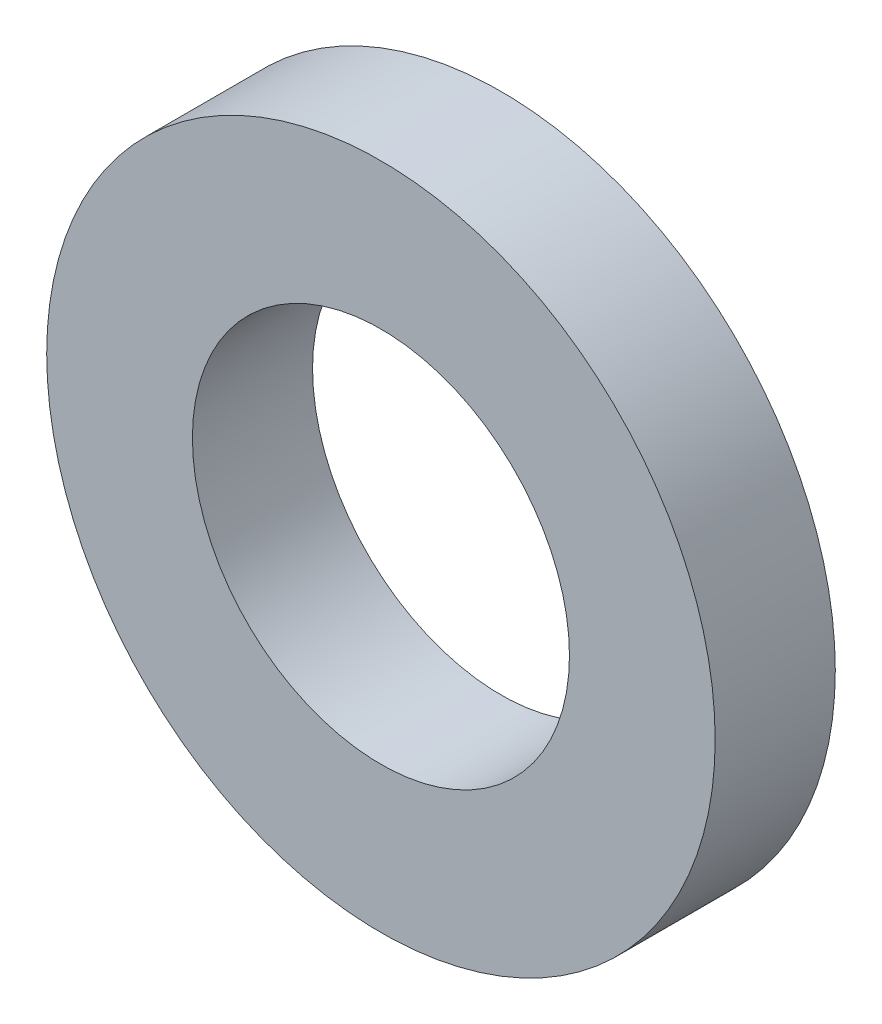
ISO-10303-21;
HEADER;
FILE_DESCRIPTION(('STEP AP214'),'2;1');
FILE_NAME('part.step','',(''),(''),'','','');
FILE_SCHEMA(('AUTOMOTIVE_DESIGN { 1 0 10303 214 1 1 1 1 }'));
ENDSEC;
DATA;
#1=APPLICATION_CONTEXT('core data for automotive mechanical design processes');
#2=APPLICATION_PROTOCOL_DEFINITION('international standard','automotive_design',2000,#1);
#3=PRODUCT_CONTEXT('',#1,'mechanical');
#4=PRODUCT('Part','Part','',(#3));
#5=PRODUCT_RELATED_PRODUCT_CATEGORY('part','',(#4));
#6=PRODUCT_DEFINITION_FORMATION('','',#4);
#7=PRODUCT_DEFINITION_CONTEXT('part definition',#1,'design');
#8=PRODUCT_DEFINITION('design','',#6,#7);
#9=PRODUCT_DEFINITION_SHAPE('','',#8);
#10=(LENGTH_UNIT() NAMED_UNIT(*) SI_UNIT(.MILLI.,.METRE.));
#11=(NAMED_UNIT(*) PLANE_ANGLE_UNIT() SI_UNIT($,.RADIAN.));
#12=(NAMED_UNIT(*) SI_UNIT($,.STERADIAN.) SOLID_ANGLE_UNIT());
#13=UNCERTAINTY_MEASURE_WITH_UNIT(LENGTH_MEASURE(1.E-05),#10,'distance_accuracy_value','');
#14=(GEOMETRIC_REPRESENTATION_CONTEXT(3) GLOBAL_UNCERTAINTY_ASSIGNED_CONTEXT((#13)) GLOBAL_UNIT_ASSIGNED_CONTEXT((#10,
#11,#12)) REPRESENTATION_CONTEXT('',''));
#15=CARTESIAN_POINT('',(0.,0.,0.));
#16=DIRECTION('',(0.,0.,1.));
#17=DIRECTION('',(1.,0.,0.));
#18=AXIS2_PLACEMENT_3D('',#15,#16,#17);
#19=CARTESIAN_POINT('',(0.,0.,-2.5654));
#20=DIRECTION('',(0.,0.,1.));
#21=DIRECTION('',(1.,0.,0.));
#22=AXIS2_PLACEMENT_3D('',#19,#20,#21);
#23=CYLINDRICAL_SURFACE('',#22,4.0259);
#24=CARTESIAN_POINT('',(0.,0.,0.));
#25=DIRECTION('',(0.,0.,1.));
#26=DIRECTION('',(1.,0.,0.));
#27=AXIS2_PLACEMENT_3D('',#24,#25,#26);
#28=CIRCLE('',#27,4.0259);
#29=CARTESIAN_POINT('',(4.0259,0.,0.));
#30=VERTEX_POINT('',#29);
#31=EDGE_CURVE('E18',#30,#30,#28,.F.);
#32=ORIENTED_EDGE('',*,*,#31,.F.);
#33=EDGE_LOOP('',(#32));
#34=FACE_BOUND('',#33,.T.);
#35=CARTESIAN_POINT('',(0.,0.,-2.5654));
#36=DIRECTION('',(0.,0.,1.));
#37=DIRECTION('',(1.,0.,0.));
#38=AXIS2_PLACEMENT_3D('',#35,#36,#37);
#39=CIRCLE('',#38,4.0259);
#40=CARTESIAN_POINT('',(4.0259,0.,-2.5654));
#41=VERTEX_POINT('',#40);
#42=EDGE_CURVE('E27',#41,#41,#39,.F.);
#43=ORIENTED_EDGE('',*,*,#42,.T.);
#44=EDGE_LOOP('',(#43));
#45=FACE_BOUND('',#44,.T.);
#46=ADVANCED_FACE('F15',(#34,#45),#23,.F.);
#47=CARTESIAN_POINT('',(0.,0.,0.));
#48=DIRECTION('',(0.,0.,1.));
#49=DIRECTION('',(1.,0.,0.));
#50=AXIS2_PLACEMENT_3D('',#47,#48,#49);
#51=PLANE('',#50);
#52=ORIENTED_EDGE('',*,*,#31,.T.);
#53=EDGE_LOOP('',(#52));
#54=FACE_BOUND('',#53,.T.);
#55=CARTESIAN_POINT('',(0.,0.,0.));
#56=DIRECTION('',(0.,0.,1.));
#57=DIRECTION('',(1.,0.,0.));
#58=AXIS2_PLACEMENT_3D('',#55,#56,#57);
#59=CIRCLE('',#58,7.1374);
#60=CARTESIAN_POINT('',(7.1374,0.,0.));
#61=VERTEX_POINT('',#60);
#62=EDGE_CURVE('E22',#61,#61,#59,.F.);
#63=ORIENTED_EDGE('',*,*,#62,.F.);
#64=EDGE_LOOP('',(#63));
#65=FACE_BOUND('',#64,.T.);
#66=ADVANCED_FACE('F35',(#54,#65),#51,.T.);
#67=CARTESIAN_POINT('',(0.,0.,-2.5654));
#68=DIRECTION('',(0.,0.,1.));
#69=DIRECTION('',(1.,0.,0.));
#70=AXIS2_PLACEMENT_3D('',#67,#68,#69);
#71=PLANE('',#70);
#72=ORIENTED_EDGE('',*,*,#42,.F.);
#73=EDGE_LOOP('',(#72));
#74=FACE_BOUND('',#73,.T.);
#75=CARTESIAN_POINT('',(0.,0.,-2.5654));
#76=DIRECTION('',(0.,0.,1.));
#77=DIRECTION('',(1.,0.,0.));
#78=AXIS2_PLACEMENT_3D('',#75,#76,#77);
#79=CIRCLE('',#78,7.1374);
#80=CARTESIAN_POINT('',(7.1374,0.,-2.5654));
#81=VERTEX_POINT('',#80);
#82=EDGE_CURVE('E10',#81,#81,#79,.T.);
#83=ORIENTED_EDGE('',*,*,#82,.F.);
#84=EDGE_LOOP('',(#83));
#85=FACE_BOUND('',#84,.T.);
#86=ADVANCED_FACE('F43',(#74,#85),#71,.F.);
#87=CARTESIAN_POINT('',(0.,0.,-2.5654));
#88=DIRECTION('',(0.,0.,1.));
#89=DIRECTION('',(1.,0.,0.));
#90=AXIS2_PLACEMENT_3D('',#87,#88,#89);
#91=CYLINDRICAL_SURFACE('',#90,7.1374);
#92=ORIENTED_EDGE('',*,*,#82,.T.);
#93=EDGE_LOOP('',(#92));
#94=FACE_BOUND('',#93,.T.);
#95=ORIENTED_EDGE('',*,*,#62,.T.);
#96=EDGE_LOOP('',(#95));
#97=FACE_BOUND('',#96,.T.);
#98=ADVANCED_FACE('F44',(#94,#97),#91,.T.);
#99=CLOSED_SHELL('',(#46,#66,#86,#98));
#100=MANIFOLD_SOLID_BREP('B1',#99);
#101=ADVANCED_BREP_SHAPE_REPRESENTATION('',(#18,#100),#14);
#102=SHAPE_DEFINITION_REPRESENTATION(#9,#101);
ENDSEC;
END-ISO-10303-21;
